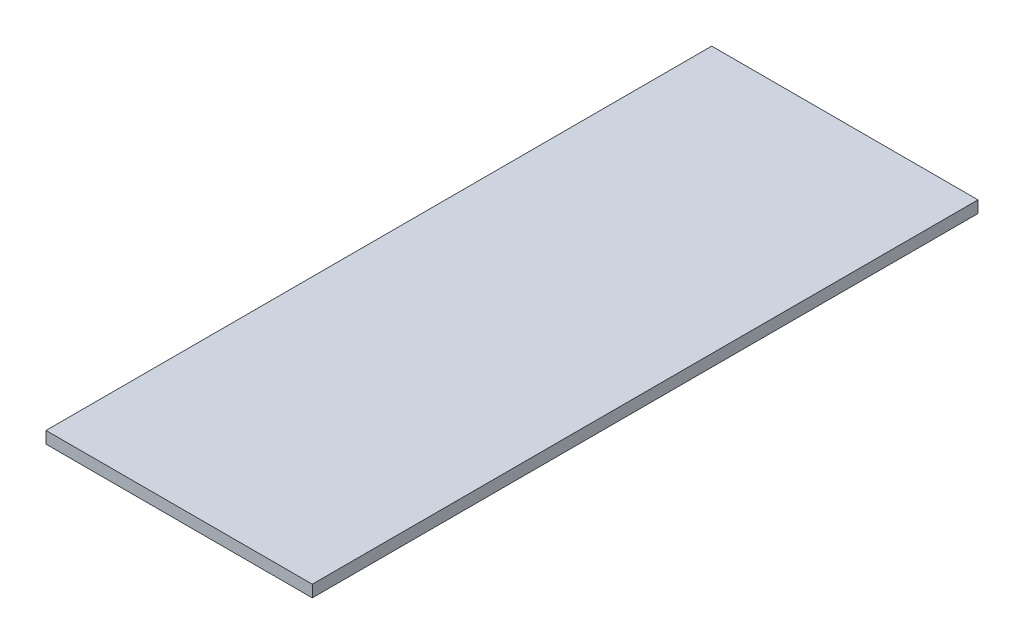
ISO-10303-21;
HEADER;
FILE_DESCRIPTION(('STEP AP214'),'2;1');
FILE_NAME('part.step','',(''),(''),'','','');
FILE_SCHEMA(('AUTOMOTIVE_DESIGN { 1 0 10303 214 1 1 1 1 }'));
ENDSEC;
DATA;
#1=APPLICATION_CONTEXT('core data for automotive mechanical design processes');
#2=APPLICATION_PROTOCOL_DEFINITION('international standard','automotive_design',2000,#1);
#3=PRODUCT_CONTEXT('',#1,'mechanical');
#4=PRODUCT('Part','Part','',(#3));
#5=PRODUCT_RELATED_PRODUCT_CATEGORY('part','',(#4));
#6=PRODUCT_DEFINITION_FORMATION('','',#4);
#7=PRODUCT_DEFINITION_CONTEXT('part definition',#1,'design');
#8=PRODUCT_DEFINITION('design','',#6,#7);
#9=PRODUCT_DEFINITION_SHAPE('','',#8);
#10=(LENGTH_UNIT() NAMED_UNIT(*) SI_UNIT(.MILLI.,.METRE.));
#11=(NAMED_UNIT(*) PLANE_ANGLE_UNIT() SI_UNIT($,.RADIAN.));
#12=(NAMED_UNIT(*) SI_UNIT($,.STERADIAN.) SOLID_ANGLE_UNIT());
#13=UNCERTAINTY_MEASURE_WITH_UNIT(LENGTH_MEASURE(1.E-05),#10,'distance_accuracy_value','');
#14=(GEOMETRIC_REPRESENTATION_CONTEXT(3) GLOBAL_UNCERTAINTY_ASSIGNED_CONTEXT((#13)) GLOBAL_UNIT_ASSIGNED_CONTEXT((#10,
#11,#12)) REPRESENTATION_CONTEXT('',''));
#15=CARTESIAN_POINT('',(0.,0.,0.));
#16=DIRECTION('',(0.,0.,1.));
#17=DIRECTION('',(1.,0.,0.));
#18=AXIS2_PLACEMENT_3D('',#15,#16,#17);
#19=CARTESIAN_POINT('',(0.,3.175,0.));
#20=DIRECTION('',(1.,0.,0.));
#21=DIRECTION('',(0.,0.,-1.));
#22=AXIS2_PLACEMENT_3D('',#19,#20,#21);
#23=PLANE('',#22);
#24=DIRECTION('',(0.,0.,1.));
#25=VECTOR('',#24,1.);
#26=CARTESIAN_POINT('',(0.,0.,0.));
#27=LINE('',#26,#25);
#28=CARTESIAN_POINT('',(0.,0.,-177.8));
#29=VERTEX_POINT('',#28);
#30=CARTESIAN_POINT('',(0.,0.,0.));
#31=VERTEX_POINT('',#30);
#32=EDGE_CURVE('E96',#29,#31,#27,.T.);
#33=ORIENTED_EDGE('',*,*,#32,.T.);
#34=DIRECTION('',(0.,-1.,0.));
#35=VECTOR('',#34,1.);
#36=CARTESIAN_POINT('',(0.,3.175,0.));
#37=LINE('',#36,#35);
#38=CARTESIAN_POINT('',(0.,3.175,0.));
#39=VERTEX_POINT('',#38);
#40=EDGE_CURVE('E11',#39,#31,#37,.T.);
#41=ORIENTED_EDGE('',*,*,#40,.F.);
#42=DIRECTION('',(0.,0.,1.));
#43=VECTOR('',#42,1.);
#44=CARTESIAN_POINT('',(0.,3.175,0.));
#45=LINE('',#44,#43);
#46=CARTESIAN_POINT('',(0.,3.175,-177.8));
#47=VERTEX_POINT('',#46);
#48=EDGE_CURVE('E84',#47,#39,#45,.T.);
#49=ORIENTED_EDGE('',*,*,#48,.F.);
#50=DIRECTION('',(0.,-1.,0.));
#51=VECTOR('',#50,1.);
#52=CARTESIAN_POINT('',(0.,3.175,-177.8));
#53=LINE('',#52,#51);
#54=EDGE_CURVE('E92',#47,#29,#53,.T.);
#55=ORIENTED_EDGE('',*,*,#54,.T.);
#56=EDGE_LOOP('',(#33,#41,#49,#55));
#57=FACE_BOUND('',#56,.T.);
#58=ADVANCED_FACE('F33',(#57),#23,.F.);
#59=CARTESIAN_POINT('',(0.,3.175,0.));
#60=DIRECTION('',(0.,0.,-1.));
#61=DIRECTION('',(-1.,0.,0.));
#62=AXIS2_PLACEMENT_3D('',#59,#60,#61);
#63=PLANE('',#62);
#64=DIRECTION('',(1.,0.,0.));
#65=VECTOR('',#64,1.);
#66=CARTESIAN_POINT('',(0.,0.,0.));
#67=LINE('',#66,#65);
#68=CARTESIAN_POINT('',(71.12,0.,0.));
#69=VERTEX_POINT('',#68);
#70=EDGE_CURVE('E88',#31,#69,#67,.T.);
#71=ORIENTED_EDGE('',*,*,#70,.T.);
#72=DIRECTION('',(0.,-1.,0.));
#73=VECTOR('',#72,1.);
#74=CARTESIAN_POINT('',(71.12,3.175,0.));
#75=LINE('',#74,#73);
#76=CARTESIAN_POINT('',(71.12,3.175,0.));
#77=VERTEX_POINT('',#76);
#78=EDGE_CURVE('E41',#77,#69,#75,.T.);
#79=ORIENTED_EDGE('',*,*,#78,.F.);
#80=DIRECTION('',(1.,0.,0.));
#81=VECTOR('',#80,1.);
#82=CARTESIAN_POINT('',(0.,3.175,0.));
#83=LINE('',#82,#81);
#84=EDGE_CURVE('E79',#39,#77,#83,.T.);
#85=ORIENTED_EDGE('',*,*,#84,.F.);
#86=ORIENTED_EDGE('',*,*,#40,.T.);
#87=EDGE_LOOP('',(#71,#79,#85,#86));
#88=FACE_BOUND('',#87,.T.);
#89=ADVANCED_FACE('F87',(#88),#63,.F.);
#90=CARTESIAN_POINT('',(71.12,3.175,0.));
#91=DIRECTION('',(-1.,0.,0.));
#92=DIRECTION('',(0.,0.,1.));
#93=AXIS2_PLACEMENT_3D('',#90,#91,#92);
#94=PLANE('',#93);
#95=DIRECTION('',(0.,0.,-1.));
#96=VECTOR('',#95,1.);
#97=CARTESIAN_POINT('',(71.12,0.,0.));
#98=LINE('',#97,#96);
#99=CARTESIAN_POINT('',(71.12,0.,-177.8));
#100=VERTEX_POINT('',#99);
#101=EDGE_CURVE('E66',#69,#100,#98,.T.);
#102=ORIENTED_EDGE('',*,*,#101,.T.);
#103=DIRECTION('',(0.,-1.,0.));
#104=VECTOR('',#103,1.);
#105=CARTESIAN_POINT('',(71.12,3.175,-177.8));
#106=LINE('',#105,#104);
#107=CARTESIAN_POINT('',(71.12,3.175,-177.8));
#108=VERTEX_POINT('',#107);
#109=EDGE_CURVE('E89',#108,#100,#106,.T.);
#110=ORIENTED_EDGE('',*,*,#109,.F.);
#111=DIRECTION('',(0.,0.,-1.));
#112=VECTOR('',#111,1.);
#113=CARTESIAN_POINT('',(71.12,3.175,0.));
#114=LINE('',#113,#112);
#115=EDGE_CURVE('E82',#77,#108,#114,.T.);
#116=ORIENTED_EDGE('',*,*,#115,.F.);
#117=ORIENTED_EDGE('',*,*,#78,.T.);
#118=EDGE_LOOP('',(#102,#110,#116,#117));
#119=FACE_BOUND('',#118,.T.);
#120=ADVANCED_FACE('F90',(#119),#94,.F.);
#121=CARTESIAN_POINT('',(0.,3.175,-177.8));
#122=DIRECTION('',(0.,0.,1.));
#123=DIRECTION('',(1.,0.,0.));
#124=AXIS2_PLACEMENT_3D('',#121,#122,#123);
#125=PLANE('',#124);
#126=DIRECTION('',(-1.,0.,0.));
#127=VECTOR('',#126,1.);
#128=CARTESIAN_POINT('',(0.,0.,-177.8));
#129=LINE('',#128,#127);
#130=EDGE_CURVE('E72',#100,#29,#129,.T.);
#131=ORIENTED_EDGE('',*,*,#130,.T.);
#132=ORIENTED_EDGE('',*,*,#54,.F.);
#133=DIRECTION('',(-1.,0.,0.));
#134=VECTOR('',#133,1.);
#135=CARTESIAN_POINT('',(0.,3.175,-177.8));
#136=LINE('',#135,#134);
#137=EDGE_CURVE('E49',#108,#47,#136,.T.);
#138=ORIENTED_EDGE('',*,*,#137,.F.);
#139=ORIENTED_EDGE('',*,*,#109,.T.);
#140=EDGE_LOOP('',(#131,#132,#138,#139));
#141=FACE_BOUND('',#140,.T.);
#142=ADVANCED_FACE('F103',(#141),#125,.F.);
#143=CARTESIAN_POINT('',(0.,3.175,0.));
#144=DIRECTION('',(0.,-1.,0.));
#145=DIRECTION('',(0.,0.,-1.));
#146=AXIS2_PLACEMENT_3D('',#143,#144,#145);
#147=PLANE('',#146);
#148=ORIENTED_EDGE('',*,*,#48,.T.);
#149=ORIENTED_EDGE('',*,*,#84,.T.);
#150=ORIENTED_EDGE('',*,*,#115,.T.);
#151=ORIENTED_EDGE('',*,*,#137,.T.);
#152=EDGE_LOOP('',(#148,#149,#150,#151));
#153=FACE_BOUND('',#152,.T.);
#154=ADVANCED_FACE('F80',(#153),#147,.F.);
#155=CARTESIAN_POINT('',(0.,0.,0.));
#156=DIRECTION('',(0.,-1.,0.));
#157=DIRECTION('',(0.,0.,-1.));
#158=AXIS2_PLACEMENT_3D('',#155,#156,#157);
#159=PLANE('',#158);
#160=ORIENTED_EDGE('',*,*,#32,.F.);
#161=ORIENTED_EDGE('',*,*,#130,.F.);
#162=ORIENTED_EDGE('',*,*,#101,.F.);
#163=ORIENTED_EDGE('',*,*,#70,.F.);
#164=EDGE_LOOP('',(#160,#161,#162,#163));
#165=FACE_BOUND('',#164,.T.);
#166=ADVANCED_FACE('F106',(#165),#159,.T.);
#167=CLOSED_SHELL('',(#58,#89,#120,#142,#154,#166));
#168=MANIFOLD_SOLID_BREP('B2',#167);
#169=ADVANCED_BREP_SHAPE_REPRESENTATION('',(#18,#168),#14);
#170=SHAPE_DEFINITION_REPRESENTATION(#9,#169);
ENDSEC;
END-ISO-10303-21;
